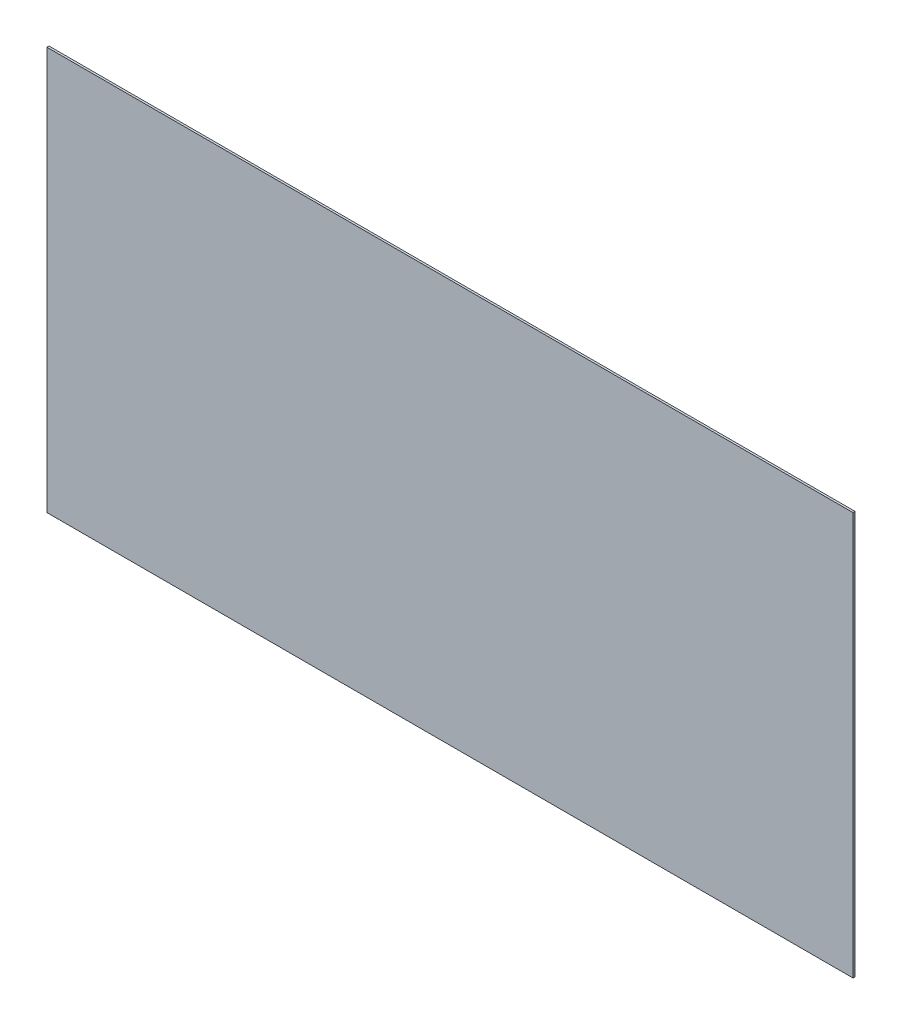
ISO-10303-21;
HEADER;
FILE_DESCRIPTION(('STEP AP214'),'2;1');
FILE_NAME('part.step','',(''),(''),'','','');
FILE_SCHEMA(('AUTOMOTIVE_DESIGN { 1 0 10303 214 1 1 1 1 }'));
ENDSEC;
DATA;
#1=APPLICATION_CONTEXT('core data for automotive mechanical design processes');
#2=APPLICATION_PROTOCOL_DEFINITION('international standard','automotive_design',2000,#1);
#3=PRODUCT_CONTEXT('',#1,'mechanical');
#4=PRODUCT('Part','Part','',(#3));
#5=PRODUCT_RELATED_PRODUCT_CATEGORY('part','',(#4));
#6=PRODUCT_DEFINITION_FORMATION('','',#4);
#7=PRODUCT_DEFINITION_CONTEXT('part definition',#1,'design');
#8=PRODUCT_DEFINITION('design','',#6,#7);
#9=PRODUCT_DEFINITION_SHAPE('','',#8);
#10=(LENGTH_UNIT() NAMED_UNIT(*) SI_UNIT(.MILLI.,.METRE.));
#11=(NAMED_UNIT(*) PLANE_ANGLE_UNIT() SI_UNIT($,.RADIAN.));
#12=(NAMED_UNIT(*) SI_UNIT($,.STERADIAN.) SOLID_ANGLE_UNIT());
#13=UNCERTAINTY_MEASURE_WITH_UNIT(LENGTH_MEASURE(1.E-05),#10,'distance_accuracy_value','');
#14=(GEOMETRIC_REPRESENTATION_CONTEXT(3) GLOBAL_UNCERTAINTY_ASSIGNED_CONTEXT((#13)) GLOBAL_UNIT_ASSIGNED_CONTEXT((#10,
#11,#12)) REPRESENTATION_CONTEXT('',''));
#15=CARTESIAN_POINT('',(0.,0.,0.));
#16=DIRECTION('',(0.,0.,1.));
#17=DIRECTION('',(1.,0.,0.));
#18=AXIS2_PLACEMENT_3D('',#15,#16,#17);
#19=CARTESIAN_POINT('',(-1219.2,-609.6,3.175));
#20=DIRECTION('',(0.,1.,0.));
#21=DIRECTION('',(0.,0.,1.));
#22=AXIS2_PLACEMENT_3D('',#19,#20,#21);
#23=PLANE('',#22);
#24=DIRECTION('',(1.,0.,0.));
#25=VECTOR('',#24,1.);
#26=CARTESIAN_POINT('',(-1219.2,-609.6,-3.175));
#27=LINE('',#26,#25);
#28=CARTESIAN_POINT('',(-1219.2,-609.6,-3.175));
#29=VERTEX_POINT('',#28);
#30=CARTESIAN_POINT('',(1219.2,-609.6,-3.175));
#31=VERTEX_POINT('',#30);
#32=EDGE_CURVE('E111',#29,#31,#27,.T.);
#33=ORIENTED_EDGE('',*,*,#32,.T.);
#34=DIRECTION('',(0.,0.,-1.));
#35=VECTOR('',#34,1.);
#36=CARTESIAN_POINT('',(1219.2,-609.6,3.175));
#37=LINE('',#36,#35);
#38=CARTESIAN_POINT('',(1219.2,-609.6,3.175));
#39=VERTEX_POINT('',#38);
#40=EDGE_CURVE('E11',#39,#31,#37,.T.);
#41=ORIENTED_EDGE('',*,*,#40,.F.);
#42=DIRECTION('',(1.,0.,0.));
#43=VECTOR('',#42,1.);
#44=CARTESIAN_POINT('',(-1219.2,-609.6,3.175));
#45=LINE('',#44,#43);
#46=CARTESIAN_POINT('',(-1219.2,-609.6,3.175));
#47=VERTEX_POINT('',#46);
#48=EDGE_CURVE('E95',#47,#39,#45,.T.);
#49=ORIENTED_EDGE('',*,*,#48,.F.);
#50=DIRECTION('',(0.,0.,-1.));
#51=VECTOR('',#50,1.);
#52=CARTESIAN_POINT('',(-1219.2,-609.6,3.175));
#53=LINE('',#52,#51);
#54=EDGE_CURVE('E107',#47,#29,#53,.T.);
#55=ORIENTED_EDGE('',*,*,#54,.T.);
#56=EDGE_LOOP('',(#33,#41,#49,#55));
#57=FACE_BOUND('',#56,.T.);
#58=ADVANCED_FACE('F43',(#57),#23,.F.);
#59=CARTESIAN_POINT('',(1219.2,-609.6,3.175));
#60=DIRECTION('',(-1.,0.,0.));
#61=DIRECTION('',(0.,0.,1.));
#62=AXIS2_PLACEMENT_3D('',#59,#60,#61);
#63=PLANE('',#62);
#64=DIRECTION('',(0.,1.,0.));
#65=VECTOR('',#64,1.);
#66=CARTESIAN_POINT('',(1219.2,-609.6,-3.175));
#67=LINE('',#66,#65);
#68=CARTESIAN_POINT('',(1219.2,609.6,-3.175));
#69=VERTEX_POINT('',#68);
#70=EDGE_CURVE('E100',#31,#69,#67,.T.);
#71=ORIENTED_EDGE('',*,*,#70,.T.);
#72=DIRECTION('',(0.,0.,-1.));
#73=VECTOR('',#72,1.);
#74=CARTESIAN_POINT('',(1219.2,609.6,3.175));
#75=LINE('',#74,#73);
#76=CARTESIAN_POINT('',(1219.2,609.6,3.175));
#77=VERTEX_POINT('',#76);
#78=EDGE_CURVE('E52',#77,#69,#75,.T.);
#79=ORIENTED_EDGE('',*,*,#78,.F.);
#80=DIRECTION('',(0.,1.,0.));
#81=VECTOR('',#80,1.);
#82=CARTESIAN_POINT('',(1219.2,-609.6,3.175));
#83=LINE('',#82,#81);
#84=EDGE_CURVE('E90',#39,#77,#83,.T.);
#85=ORIENTED_EDGE('',*,*,#84,.F.);
#86=ORIENTED_EDGE('',*,*,#40,.T.);
#87=EDGE_LOOP('',(#71,#79,#85,#86));
#88=FACE_BOUND('',#87,.T.);
#89=ADVANCED_FACE('F99',(#88),#63,.F.);
#90=CARTESIAN_POINT('',(-1219.2,609.6,3.175));
#91=DIRECTION('',(0.,-1.,0.));
#92=DIRECTION('',(0.,0.,-1.));
#93=AXIS2_PLACEMENT_3D('',#90,#91,#92);
#94=PLANE('',#93);
#95=DIRECTION('',(-1.,0.,0.));
#96=VECTOR('',#95,1.);
#97=CARTESIAN_POINT('',(-1219.2,609.6,-3.175));
#98=LINE('',#97,#96);
#99=CARTESIAN_POINT('',(-1219.2,609.6,-3.175));
#100=VERTEX_POINT('',#99);
#101=EDGE_CURVE('E77',#69,#100,#98,.T.);
#102=ORIENTED_EDGE('',*,*,#101,.T.);
#103=DIRECTION('',(0.,0.,-1.));
#104=VECTOR('',#103,1.);
#105=CARTESIAN_POINT('',(-1219.2,609.6,3.175));
#106=LINE('',#105,#104);
#107=CARTESIAN_POINT('',(-1219.2,609.6,3.175));
#108=VERTEX_POINT('',#107);
#109=EDGE_CURVE('E102',#108,#100,#106,.T.);
#110=ORIENTED_EDGE('',*,*,#109,.F.);
#111=DIRECTION('',(-1.,0.,0.));
#112=VECTOR('',#111,1.);
#113=CARTESIAN_POINT('',(-1219.2,609.6,3.175));
#114=LINE('',#113,#112);
#115=EDGE_CURVE('E93',#77,#108,#114,.T.);
#116=ORIENTED_EDGE('',*,*,#115,.F.);
#117=ORIENTED_EDGE('',*,*,#78,.T.);
#118=EDGE_LOOP('',(#102,#110,#116,#117));
#119=FACE_BOUND('',#118,.T.);
#120=ADVANCED_FACE('F103',(#119),#94,.F.);
#121=CARTESIAN_POINT('',(-1219.2,-609.6,3.175));
#122=DIRECTION('',(1.,0.,0.));
#123=DIRECTION('',(0.,0.,-1.));
#124=AXIS2_PLACEMENT_3D('',#121,#122,#123);
#125=PLANE('',#124);
#126=DIRECTION('',(0.,-1.,0.));
#127=VECTOR('',#126,1.);
#128=CARTESIAN_POINT('',(-1219.2,-609.6,-3.175));
#129=LINE('',#128,#127);
#130=EDGE_CURVE('E83',#100,#29,#129,.T.);
#131=ORIENTED_EDGE('',*,*,#130,.T.);
#132=ORIENTED_EDGE('',*,*,#54,.F.);
#133=DIRECTION('',(0.,-1.,0.));
#134=VECTOR('',#133,1.);
#135=CARTESIAN_POINT('',(-1219.2,-609.6,3.175));
#136=LINE('',#135,#134);
#137=EDGE_CURVE('E60',#108,#47,#136,.T.);
#138=ORIENTED_EDGE('',*,*,#137,.F.);
#139=ORIENTED_EDGE('',*,*,#109,.T.);
#140=EDGE_LOOP('',(#131,#132,#138,#139));
#141=FACE_BOUND('',#140,.T.);
#142=ADVANCED_FACE('F124',(#141),#125,.F.);
#143=CARTESIAN_POINT('',(0.,0.,3.175));
#144=DIRECTION('',(0.,0.,1.));
#145=DIRECTION('',(1.,0.,0.));
#146=AXIS2_PLACEMENT_3D('',#143,#144,#145);
#147=PLANE('',#146);
#148=ORIENTED_EDGE('',*,*,#48,.T.);
#149=ORIENTED_EDGE('',*,*,#84,.T.);
#150=ORIENTED_EDGE('',*,*,#115,.T.);
#151=ORIENTED_EDGE('',*,*,#137,.T.);
#152=EDGE_LOOP('',(#148,#149,#150,#151));
#153=FACE_BOUND('',#152,.T.);
#154=ADVANCED_FACE('F91',(#153),#147,.T.);
#155=CARTESIAN_POINT('',(0.,0.,-3.175));
#156=DIRECTION('',(0.,0.,1.));
#157=DIRECTION('',(1.,0.,0.));
#158=AXIS2_PLACEMENT_3D('',#155,#156,#157);
#159=PLANE('',#158);
#160=ORIENTED_EDGE('',*,*,#32,.F.);
#161=ORIENTED_EDGE('',*,*,#130,.F.);
#162=ORIENTED_EDGE('',*,*,#101,.F.);
#163=ORIENTED_EDGE('',*,*,#70,.F.);
#164=EDGE_LOOP('',(#160,#161,#162,#163));
#165=FACE_BOUND('',#164,.T.);
#166=ADVANCED_FACE('F127',(#165),#159,.F.);
#167=CLOSED_SHELL('',(#58,#89,#120,#142,#154,#166));
#168=MANIFOLD_SOLID_BREP('B2',#167);
#169=ADVANCED_BREP_SHAPE_REPRESENTATION('',(#18,#168),#14);
#170=SHAPE_DEFINITION_REPRESENTATION(#9,#169);
ENDSEC;
END-ISO-10303-21;
